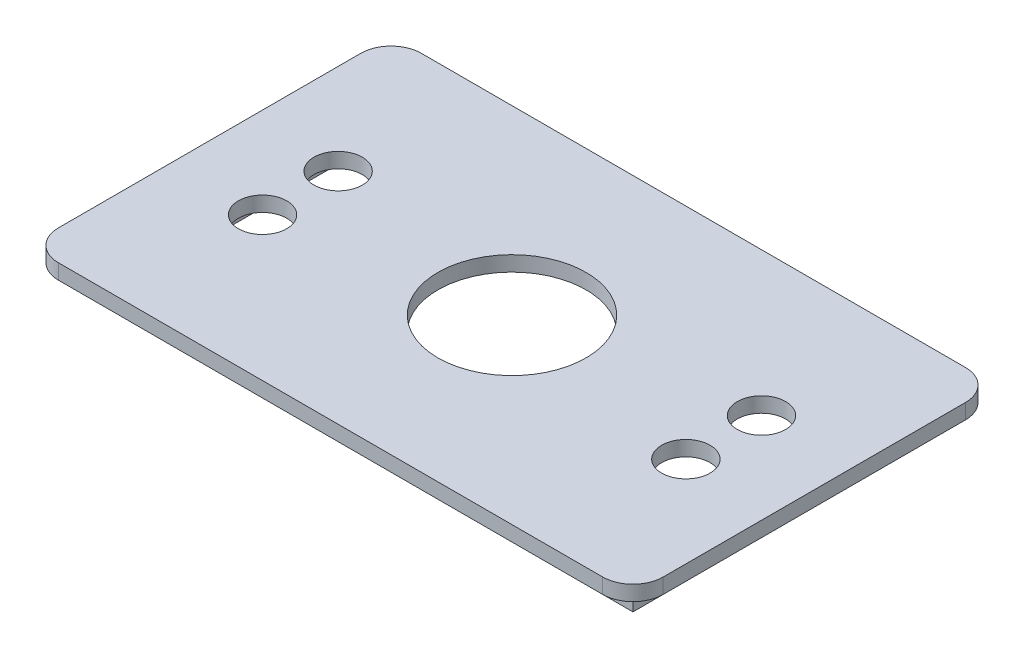
ISO-10303-21;
HEADER;
FILE_DESCRIPTION(('STEP AP214'),'2;1');
FILE_NAME('part.step','',(''),(''),'','','');
FILE_SCHEMA(('AUTOMOTIVE_DESIGN { 1 0 10303 214 1 1 1 1 }'));
ENDSEC;
DATA;
#1=APPLICATION_CONTEXT('core data for automotive mechanical design processes');
#2=APPLICATION_PROTOCOL_DEFINITION('international standard','automotive_design',2000,#1);
#3=PRODUCT_CONTEXT('',#1,'mechanical');
#4=PRODUCT('Part','Part','',(#3));
#5=PRODUCT_RELATED_PRODUCT_CATEGORY('part','',(#4));
#6=PRODUCT_DEFINITION_FORMATION('','',#4);
#7=PRODUCT_DEFINITION_CONTEXT('part definition',#1,'design');
#8=PRODUCT_DEFINITION('design','',#6,#7);
#9=PRODUCT_DEFINITION_SHAPE('','',#8);
#10=(LENGTH_UNIT() NAMED_UNIT(*) SI_UNIT(.MILLI.,.METRE.));
#11=(NAMED_UNIT(*) PLANE_ANGLE_UNIT() SI_UNIT($,.RADIAN.));
#12=(NAMED_UNIT(*) SI_UNIT($,.STERADIAN.) SOLID_ANGLE_UNIT());
#13=UNCERTAINTY_MEASURE_WITH_UNIT(LENGTH_MEASURE(1.E-05),#10,'distance_accuracy_value','');
#14=(GEOMETRIC_REPRESENTATION_CONTEXT(3) GLOBAL_UNCERTAINTY_ASSIGNED_CONTEXT((#13)) GLOBAL_UNIT_ASSIGNED_CONTEXT((#10,
#11,#12)) REPRESENTATION_CONTEXT('',''));
#15=CARTESIAN_POINT('',(0.,0.,0.));
#16=DIRECTION('',(0.,0.,1.));
#17=DIRECTION('',(1.,0.,0.));
#18=AXIS2_PLACEMENT_3D('',#15,#16,#17);
#19=CARTESIAN_POINT('',(-90.,0.,50.));
#20=DIRECTION('',(0.,1.,0.));
#21=DIRECTION('',(0.,0.,1.));
#22=AXIS2_PLACEMENT_3D('',#19,#20,#21);
#23=PLANE('',#22);
#24=CARTESIAN_POINT('',(-90.,0.,50.));
#25=DIRECTION('',(0.,1.,0.));
#26=DIRECTION('',(0.,0.,1.));
#27=AXIS2_PLACEMENT_3D('',#24,#25,#26);
#28=CIRCLE('',#27,9.99999999999999);
#29=CARTESIAN_POINT('',(-100.,0.,50.));
#30=VERTEX_POINT('',#29);
#31=CARTESIAN_POINT('',(-90.,0.,60.));
#32=VERTEX_POINT('',#31);
#33=EDGE_CURVE('E288',#30,#32,#28,.T.);
#34=ORIENTED_EDGE('',*,*,#33,.F.);
#35=DIRECTION('',(0.,0.,1.));
#36=VECTOR('',#35,1.);
#37=CARTESIAN_POINT('',(-100.,0.,-50.));
#38=LINE('',#37,#36);
#39=CARTESIAN_POINT('',(-100.,0.,-50.));
#40=VERTEX_POINT('',#39);
#41=EDGE_CURVE('E297',#40,#30,#38,.T.);
#42=ORIENTED_EDGE('',*,*,#41,.F.);
#43=CARTESIAN_POINT('',(-90.,0.,-50.));
#44=DIRECTION('',(0.,1.,0.));
#45=DIRECTION('',(0.,0.,1.));
#46=AXIS2_PLACEMENT_3D('',#43,#44,#45);
#47=CIRCLE('',#46,9.99999999999999);
#48=CARTESIAN_POINT('',(-90.,0.,-60.));
#49=VERTEX_POINT('',#48);
#50=EDGE_CURVE('E337',#49,#40,#47,.T.);
#51=ORIENTED_EDGE('',*,*,#50,.F.);
#52=DIRECTION('',(-1.,0.,0.));
#53=VECTOR('',#52,1.);
#54=CARTESIAN_POINT('',(-90.,0.,-60.));
#55=LINE('',#54,#53);
#56=CARTESIAN_POINT('',(90.,0.,-60.));
#57=VERTEX_POINT('',#56);
#58=EDGE_CURVE('E334',#57,#49,#55,.T.);
#59=ORIENTED_EDGE('',*,*,#58,.F.);
#60=CARTESIAN_POINT('',(90.,0.,-50.));
#61=DIRECTION('',(0.,1.,0.));
#62=DIRECTION('',(0.,0.,-1.));
#63=AXIS2_PLACEMENT_3D('',#60,#61,#62);
#64=CIRCLE('',#63,9.99999999999999);
#65=CARTESIAN_POINT('',(100.,0.,-50.));
#66=VERTEX_POINT('',#65);
#67=EDGE_CURVE('E331',#66,#57,#64,.T.);
#68=ORIENTED_EDGE('',*,*,#67,.F.);
#69=DIRECTION('',(0.,0.,-1.));
#70=VECTOR('',#69,1.);
#71=CARTESIAN_POINT('',(100.,0.,-50.));
#72=LINE('',#71,#70);
#73=CARTESIAN_POINT('',(100.,0.,50.));
#74=VERTEX_POINT('',#73);
#75=EDGE_CURVE('E328',#74,#66,#72,.T.);
#76=ORIENTED_EDGE('',*,*,#75,.F.);
#77=CARTESIAN_POINT('',(90.,0.,50.));
#78=DIRECTION('',(0.,1.,0.));
#79=DIRECTION('',(0.,0.,1.));
#80=AXIS2_PLACEMENT_3D('',#77,#78,#79);
#81=CIRCLE('',#80,10.);
#82=CARTESIAN_POINT('',(90.,0.,60.));
#83=VERTEX_POINT('',#82);
#84=EDGE_CURVE('E325',#83,#74,#81,.T.);
#85=ORIENTED_EDGE('',*,*,#84,.F.);
#86=DIRECTION('',(1.,0.,0.));
#87=VECTOR('',#86,1.);
#88=CARTESIAN_POINT('',(-90.,0.,60.));
#89=LINE('',#88,#87);
#90=EDGE_CURVE('E322',#32,#83,#89,.T.);
#91=ORIENTED_EDGE('',*,*,#90,.F.);
#92=EDGE_LOOP('',(#34,#42,#51,#59,#68,#76,#85,#91));
#93=FACE_BOUND('',#92,.T.);
#94=DIRECTION('',(1.,0.,0.));
#95=VECTOR('',#94,1.);
#96=CARTESIAN_POINT('',(-90.,0.,-50.));
#97=LINE('',#96,#95);
#98=CARTESIAN_POINT('',(-90.,0.,-50.));
#99=VERTEX_POINT('',#98);
#100=CARTESIAN_POINT('',(90.,0.,-50.));
#101=VERTEX_POINT('',#100);
#102=EDGE_CURVE('E178',#99,#101,#97,.T.);
#103=ORIENTED_EDGE('',*,*,#102,.F.);
#104=DIRECTION('',(0.,0.,-1.));
#105=VECTOR('',#104,1.);
#106=CARTESIAN_POINT('',(-90.,0.,50.));
#107=LINE('',#106,#105);
#108=CARTESIAN_POINT('',(-90.,0.,50.));
#109=VERTEX_POINT('',#108);
#110=EDGE_CURVE('E217',#109,#99,#107,.T.);
#111=ORIENTED_EDGE('',*,*,#110,.F.);
#112=DIRECTION('',(-1.,0.,0.));
#113=VECTOR('',#112,1.);
#114=CARTESIAN_POINT('',(-90.,0.,50.));
#115=LINE('',#114,#113);
#116=CARTESIAN_POINT('',(90.,0.,50.));
#117=VERTEX_POINT('',#116);
#118=EDGE_CURVE('E66',#117,#109,#115,.T.);
#119=ORIENTED_EDGE('',*,*,#118,.F.);
#120=DIRECTION('',(0.,0.,1.));
#121=VECTOR('',#120,1.);
#122=CARTESIAN_POINT('',(90.,0.,-50.));
#123=LINE('',#122,#121);
#124=EDGE_CURVE('E61',#101,#117,#123,.T.);
#125=ORIENTED_EDGE('',*,*,#124,.F.);
#126=EDGE_LOOP('',(#103,#111,#119,#125));
#127=FACE_BOUND('',#126,.T.);
#128=ADVANCED_FACE('F45',(#93,#127),#23,.F.);
#129=CARTESIAN_POINT('',(-90.,5.,50.));
#130=DIRECTION('',(0.,1.,0.));
#131=DIRECTION('',(0.,0.,1.));
#132=AXIS2_PLACEMENT_3D('',#129,#130,#131);
#133=PLANE('',#132);
#134=CARTESIAN_POINT('',(70.,5.,-12.5));
#135=DIRECTION('',(0.,1.,0.));
#136=DIRECTION('',(0.,0.,1.));
#137=AXIS2_PLACEMENT_3D('',#134,#135,#136);
#138=CIRCLE('',#137,8.);
#139=CARTESIAN_POINT('',(70.,5.,-4.5));
#140=VERTEX_POINT('',#139);
#141=EDGE_CURVE('E260',#140,#140,#138,.T.);
#142=ORIENTED_EDGE('',*,*,#141,.F.);
#143=EDGE_LOOP('',(#142));
#144=FACE_BOUND('',#143,.T.);
#145=CARTESIAN_POINT('',(-70.,5.,-12.5));
#146=DIRECTION('',(0.,1.,0.));
#147=DIRECTION('',(0.,0.,1.));
#148=AXIS2_PLACEMENT_3D('',#145,#146,#147);
#149=CIRCLE('',#148,7.99999999999999);
#150=CARTESIAN_POINT('',(-70.,5.,-4.50000000000001));
#151=VERTEX_POINT('',#150);
#152=EDGE_CURVE('E276',#151,#151,#149,.T.);
#153=ORIENTED_EDGE('',*,*,#152,.F.);
#154=EDGE_LOOP('',(#153));
#155=FACE_BOUND('',#154,.T.);
#156=CARTESIAN_POINT('',(-90.,5.,50.));
#157=DIRECTION('',(0.,1.,0.));
#158=DIRECTION('',(0.,0.,1.));
#159=AXIS2_PLACEMENT_3D('',#156,#157,#158);
#160=CIRCLE('',#159,9.99999999999999);
#161=CARTESIAN_POINT('',(-100.,5.,50.));
#162=VERTEX_POINT('',#161);
#163=CARTESIAN_POINT('',(-90.,5.,60.));
#164=VERTEX_POINT('',#163);
#165=EDGE_CURVE('E292',#162,#164,#160,.T.);
#166=ORIENTED_EDGE('',*,*,#165,.T.);
#167=DIRECTION('',(1.,0.,0.));
#168=VECTOR('',#167,1.);
#169=CARTESIAN_POINT('',(-90.,5.,60.));
#170=LINE('',#169,#168);
#171=CARTESIAN_POINT('',(90.,5.,60.));
#172=VERTEX_POINT('',#171);
#173=EDGE_CURVE('E296',#164,#172,#170,.T.);
#174=ORIENTED_EDGE('',*,*,#173,.T.);
#175=CARTESIAN_POINT('',(90.,5.,50.));
#176=DIRECTION('',(0.,1.,0.));
#177=DIRECTION('',(0.,0.,1.));
#178=AXIS2_PLACEMENT_3D('',#175,#176,#177);
#179=CIRCLE('',#178,10.);
#180=CARTESIAN_POINT('',(100.,5.,50.));
#181=VERTEX_POINT('',#180);
#182=EDGE_CURVE('E300',#172,#181,#179,.T.);
#183=ORIENTED_EDGE('',*,*,#182,.T.);
#184=DIRECTION('',(0.,0.,-1.));
#185=VECTOR('',#184,1.);
#186=CARTESIAN_POINT('',(100.,5.,-50.));
#187=LINE('',#186,#185);
#188=CARTESIAN_POINT('',(100.,5.,-50.));
#189=VERTEX_POINT('',#188);
#190=EDGE_CURVE('E303',#181,#189,#187,.T.);
#191=ORIENTED_EDGE('',*,*,#190,.T.);
#192=CARTESIAN_POINT('',(90.,5.,-50.));
#193=DIRECTION('',(0.,1.,0.));
#194=DIRECTION('',(0.,0.,-1.));
#195=AXIS2_PLACEMENT_3D('',#192,#193,#194);
#196=CIRCLE('',#195,9.99999999999999);
#197=CARTESIAN_POINT('',(90.,5.,-60.));
#198=VERTEX_POINT('',#197);
#199=EDGE_CURVE('E306',#189,#198,#196,.T.);
#200=ORIENTED_EDGE('',*,*,#199,.T.);
#201=DIRECTION('',(-1.,0.,0.));
#202=VECTOR('',#201,1.);
#203=CARTESIAN_POINT('',(-90.,5.,-60.));
#204=LINE('',#203,#202);
#205=CARTESIAN_POINT('',(-90.,5.,-60.));
#206=VERTEX_POINT('',#205);
#207=EDGE_CURVE('E309',#198,#206,#204,.T.);
#208=ORIENTED_EDGE('',*,*,#207,.T.);
#209=CARTESIAN_POINT('',(-90.,5.,-50.));
#210=DIRECTION('',(0.,1.,0.));
#211=DIRECTION('',(0.,0.,1.));
#212=AXIS2_PLACEMENT_3D('',#209,#210,#211);
#213=CIRCLE('',#212,9.99999999999999);
#214=CARTESIAN_POINT('',(-100.,5.,-50.));
#215=VERTEX_POINT('',#214);
#216=EDGE_CURVE('E312',#206,#215,#213,.T.);
#217=ORIENTED_EDGE('',*,*,#216,.T.);
#218=DIRECTION('',(0.,0.,1.));
#219=VECTOR('',#218,1.);
#220=CARTESIAN_POINT('',(-100.,5.,-50.));
#221=LINE('',#220,#219);
#222=EDGE_CURVE('E315',#215,#162,#221,.T.);
#223=ORIENTED_EDGE('',*,*,#222,.T.);
#224=EDGE_LOOP('',(#166,#174,#183,#191,#200,#208,#217,#223));
#225=FACE_BOUND('',#224,.T.);
#226=CARTESIAN_POINT('',(0.,5.,0.));
#227=DIRECTION('',(0.,1.,0.));
#228=DIRECTION('',(0.,0.,1.));
#229=AXIS2_PLACEMENT_3D('',#226,#227,#228);
#230=CIRCLE('',#229,24.5);
#231=CARTESIAN_POINT('',(0.,5.,24.5));
#232=VERTEX_POINT('',#231);
#233=EDGE_CURVE('E284',#232,#232,#230,.T.);
#234=ORIENTED_EDGE('',*,*,#233,.F.);
#235=EDGE_LOOP('',(#234));
#236=FACE_BOUND('',#235,.T.);
#237=CARTESIAN_POINT('',(-70.,5.,12.5));
#238=DIRECTION('',(0.,1.,0.));
#239=DIRECTION('',(0.,0.,1.));
#240=AXIS2_PLACEMENT_3D('',#237,#238,#239);
#241=CIRCLE('',#240,7.99999999999999);
#242=CARTESIAN_POINT('',(-70.,5.,20.5));
#243=VERTEX_POINT('',#242);
#244=EDGE_CURVE('E268',#243,#243,#241,.T.);
#245=ORIENTED_EDGE('',*,*,#244,.F.);
#246=EDGE_LOOP('',(#245));
#247=FACE_BOUND('',#246,.T.);
#248=CARTESIAN_POINT('',(70.,5.,12.5));
#249=DIRECTION('',(0.,1.,0.));
#250=DIRECTION('',(0.,0.,1.));
#251=AXIS2_PLACEMENT_3D('',#248,#249,#250);
#252=CIRCLE('',#251,8.);
#253=CARTESIAN_POINT('',(70.,5.,20.5));
#254=VERTEX_POINT('',#253);
#255=EDGE_CURVE('E252',#254,#254,#252,.T.);
#256=ORIENTED_EDGE('',*,*,#255,.F.);
#257=EDGE_LOOP('',(#256));
#258=FACE_BOUND('',#257,.T.);
#259=ADVANCED_FACE('F388',(#144,#155,#225,#236,#247,#258),#133,.T.);
#260=DIRECTION('',(0.,0.,1.));
#261=VECTOR('',#260,1.);
#262=CARTESIAN_POINT('',(87.,0.,-47.));
#263=LINE('',#262,#261);
#264=CARTESIAN_POINT('',(87.,0.,-47.));
#265=VERTEX_POINT('',#264);
#266=CARTESIAN_POINT('',(87.,0.,47.));
#267=VERTEX_POINT('',#266);
#268=EDGE_CURVE('E170',#265,#267,#263,.T.);
#269=ORIENTED_EDGE('',*,*,#268,.T.);
#270=DIRECTION('',(-1.,0.,0.));
#271=VECTOR('',#270,1.);
#272=CARTESIAN_POINT('',(-87.,0.,47.));
#273=LINE('',#272,#271);
#274=CARTESIAN_POINT('',(-87.,0.,47.));
#275=VERTEX_POINT('',#274);
#276=EDGE_CURVE('E193',#267,#275,#273,.T.);
#277=ORIENTED_EDGE('',*,*,#276,.T.);
#278=DIRECTION('',(0.,0.,-1.));
#279=VECTOR('',#278,1.);
#280=CARTESIAN_POINT('',(-87.,0.,47.));
#281=LINE('',#280,#279);
#282=CARTESIAN_POINT('',(-87.,0.,-47.));
#283=VERTEX_POINT('',#282);
#284=EDGE_CURVE('E176',#275,#283,#281,.T.);
#285=ORIENTED_EDGE('',*,*,#284,.T.);
#286=DIRECTION('',(1.,0.,0.));
#287=VECTOR('',#286,1.);
#288=CARTESIAN_POINT('',(-87.,0.,-47.));
#289=LINE('',#288,#287);
#290=EDGE_CURVE('E198',#283,#265,#289,.T.);
#291=ORIENTED_EDGE('',*,*,#290,.T.);
#292=EDGE_LOOP('',(#269,#277,#285,#291));
#293=FACE_BOUND('',#292,.T.);
#294=CARTESIAN_POINT('',(0.,0.,0.));
#295=DIRECTION('',(0.,1.,0.));
#296=DIRECTION('',(0.,0.,1.));
#297=AXIS2_PLACEMENT_3D('',#294,#295,#296);
#298=CIRCLE('',#297,24.5);
#299=CARTESIAN_POINT('',(0.,0.,24.5));
#300=VERTEX_POINT('',#299);
#301=EDGE_CURVE('E280',#300,#300,#298,.T.);
#302=ORIENTED_EDGE('',*,*,#301,.T.);
#303=EDGE_LOOP('',(#302));
#304=FACE_BOUND('',#303,.T.);
#305=CARTESIAN_POINT('',(-70.,0.,-12.5));
#306=DIRECTION('',(0.,1.,0.));
#307=DIRECTION('',(0.,0.,1.));
#308=AXIS2_PLACEMENT_3D('',#305,#306,#307);
#309=CIRCLE('',#308,7.99999999999999);
#310=CARTESIAN_POINT('',(-70.,0.,-4.50000000000001));
#311=VERTEX_POINT('',#310);
#312=EDGE_CURVE('E272',#311,#311,#309,.T.);
#313=ORIENTED_EDGE('',*,*,#312,.T.);
#314=EDGE_LOOP('',(#313));
#315=FACE_BOUND('',#314,.T.);
#316=CARTESIAN_POINT('',(-70.,0.,12.5));
#317=DIRECTION('',(0.,1.,0.));
#318=DIRECTION('',(0.,0.,1.));
#319=AXIS2_PLACEMENT_3D('',#316,#317,#318);
#320=CIRCLE('',#319,7.99999999999999);
#321=CARTESIAN_POINT('',(-70.,0.,20.5));
#322=VERTEX_POINT('',#321);
#323=EDGE_CURVE('E264',#322,#322,#320,.T.);
#324=ORIENTED_EDGE('',*,*,#323,.T.);
#325=EDGE_LOOP('',(#324));
#326=FACE_BOUND('',#325,.T.);
#327=CARTESIAN_POINT('',(70.,0.,-12.5));
#328=DIRECTION('',(0.,1.,0.));
#329=DIRECTION('',(0.,0.,1.));
#330=AXIS2_PLACEMENT_3D('',#327,#328,#329);
#331=CIRCLE('',#330,8.);
#332=CARTESIAN_POINT('',(70.,0.,-4.5));
#333=VERTEX_POINT('',#332);
#334=EDGE_CURVE('E256',#333,#333,#331,.T.);
#335=ORIENTED_EDGE('',*,*,#334,.T.);
#336=EDGE_LOOP('',(#335));
#337=FACE_BOUND('',#336,.T.);
#338=CARTESIAN_POINT('',(70.,0.,12.5));
#339=DIRECTION('',(0.,1.,0.));
#340=DIRECTION('',(0.,0.,1.));
#341=AXIS2_PLACEMENT_3D('',#338,#339,#340);
#342=CIRCLE('',#341,8.);
#343=CARTESIAN_POINT('',(70.,0.,20.5));
#344=VERTEX_POINT('',#343);
#345=EDGE_CURVE('E251',#344,#344,#342,.T.);
#346=ORIENTED_EDGE('',*,*,#345,.T.);
#347=EDGE_LOOP('',(#346));
#348=FACE_BOUND('',#347,.T.);
#349=ADVANCED_FACE('F417',(#293,#304,#315,#326,#337,#348),#23,.F.);
#350=CARTESIAN_POINT('',(-90.,5.,50.));
#351=DIRECTION('',(0.,-1.,0.));
#352=DIRECTION('',(0.,0.,-1.));
#353=AXIS2_PLACEMENT_3D('',#350,#351,#352);
#354=CYLINDRICAL_SURFACE('',#353,9.99999999999999);
#355=ORIENTED_EDGE('',*,*,#33,.T.);
#356=DIRECTION('',(0.,-1.,0.));
#357=VECTOR('',#356,1.);
#358=CARTESIAN_POINT('',(-90.,5.,60.));
#359=LINE('',#358,#357);
#360=EDGE_CURVE('E11',#164,#32,#359,.T.);
#361=ORIENTED_EDGE('',*,*,#360,.F.);
#362=ORIENTED_EDGE('',*,*,#165,.F.);
#363=DIRECTION('',(0.,-1.,0.));
#364=VECTOR('',#363,1.);
#365=CARTESIAN_POINT('',(-100.,5.,50.));
#366=LINE('',#365,#364);
#367=EDGE_CURVE('E318',#162,#30,#366,.T.);
#368=ORIENTED_EDGE('',*,*,#367,.T.);
#369=EDGE_LOOP('',(#355,#361,#362,#368));
#370=FACE_BOUND('',#369,.T.);
#371=ADVANCED_FACE('F47',(#370),#354,.T.);
#372=CARTESIAN_POINT('',(-90.,5.,60.));
#373=DIRECTION('',(0.,0.,-1.));
#374=DIRECTION('',(-1.,0.,0.));
#375=AXIS2_PLACEMENT_3D('',#372,#373,#374);
#376=PLANE('',#375);
#377=ORIENTED_EDGE('',*,*,#90,.T.);
#378=DIRECTION('',(0.,-1.,0.));
#379=VECTOR('',#378,1.);
#380=CARTESIAN_POINT('',(90.,5.,60.));
#381=LINE('',#380,#379);
#382=EDGE_CURVE('E54',#172,#83,#381,.T.);
#383=ORIENTED_EDGE('',*,*,#382,.F.);
#384=ORIENTED_EDGE('',*,*,#173,.F.);
#385=ORIENTED_EDGE('',*,*,#360,.T.);
#386=EDGE_LOOP('',(#377,#383,#384,#385));
#387=FACE_BOUND('',#386,.T.);
#388=ADVANCED_FACE('F393',(#387),#376,.F.);
#389=CARTESIAN_POINT('',(90.,5.,50.));
#390=DIRECTION('',(0.,-1.,0.));
#391=DIRECTION('',(0.,0.,-1.));
#392=AXIS2_PLACEMENT_3D('',#389,#390,#391);
#393=CYLINDRICAL_SURFACE('',#392,10.);
#394=ORIENTED_EDGE('',*,*,#84,.T.);
#395=DIRECTION('',(0.,-1.,0.));
#396=VECTOR('',#395,1.);
#397=CARTESIAN_POINT('',(100.,5.,50.));
#398=LINE('',#397,#396);
#399=EDGE_CURVE('E361',#181,#74,#398,.T.);
#400=ORIENTED_EDGE('',*,*,#399,.F.);
#401=ORIENTED_EDGE('',*,*,#182,.F.);
#402=ORIENTED_EDGE('',*,*,#382,.T.);
#403=EDGE_LOOP('',(#394,#400,#401,#402));
#404=FACE_BOUND('',#403,.T.);
#405=ADVANCED_FACE('F370',(#404),#393,.T.);
#406=CARTESIAN_POINT('',(100.,5.,-50.));
#407=DIRECTION('',(-1.,0.,0.));
#408=DIRECTION('',(0.,0.,1.));
#409=AXIS2_PLACEMENT_3D('',#406,#407,#408);
#410=PLANE('',#409);
#411=ORIENTED_EDGE('',*,*,#75,.T.);
#412=DIRECTION('',(0.,-1.,0.));
#413=VECTOR('',#412,1.);
#414=CARTESIAN_POINT('',(100.,5.,-50.));
#415=LINE('',#414,#413);
#416=EDGE_CURVE('E357',#189,#66,#415,.T.);
#417=ORIENTED_EDGE('',*,*,#416,.F.);
#418=ORIENTED_EDGE('',*,*,#190,.F.);
#419=ORIENTED_EDGE('',*,*,#399,.T.);
#420=EDGE_LOOP('',(#411,#417,#418,#419));
#421=FACE_BOUND('',#420,.T.);
#422=ADVANCED_FACE('F380',(#421),#410,.F.);
#423=CARTESIAN_POINT('',(90.,5.,-50.));
#424=DIRECTION('',(0.,-1.,0.));
#425=DIRECTION('',(0.,0.,-1.));
#426=AXIS2_PLACEMENT_3D('',#423,#424,#425);
#427=CYLINDRICAL_SURFACE('',#426,9.99999999999999);
#428=ORIENTED_EDGE('',*,*,#67,.T.);
#429=DIRECTION('',(0.,-1.,0.));
#430=VECTOR('',#429,1.);
#431=CARTESIAN_POINT('',(90.,5.,-60.));
#432=LINE('',#431,#430);
#433=EDGE_CURVE('E353',#198,#57,#432,.T.);
#434=ORIENTED_EDGE('',*,*,#433,.F.);
#435=ORIENTED_EDGE('',*,*,#199,.F.);
#436=ORIENTED_EDGE('',*,*,#416,.T.);
#437=EDGE_LOOP('',(#428,#434,#435,#436));
#438=FACE_BOUND('',#437,.T.);
#439=ADVANCED_FACE('F384',(#438),#427,.T.);
#440=CARTESIAN_POINT('',(-90.,5.,-60.));
#441=DIRECTION('',(0.,0.,1.));
#442=DIRECTION('',(1.,0.,0.));
#443=AXIS2_PLACEMENT_3D('',#440,#441,#442);
#444=PLANE('',#443);
#445=ORIENTED_EDGE('',*,*,#58,.T.);
#446=DIRECTION('',(0.,-1.,0.));
#447=VECTOR('',#446,1.);
#448=CARTESIAN_POINT('',(-90.,5.,-60.));
#449=LINE('',#448,#447);
#450=EDGE_CURVE('E349',#206,#49,#449,.T.);
#451=ORIENTED_EDGE('',*,*,#450,.F.);
#452=ORIENTED_EDGE('',*,*,#207,.F.);
#453=ORIENTED_EDGE('',*,*,#433,.T.);
#454=EDGE_LOOP('',(#445,#451,#452,#453));
#455=FACE_BOUND('',#454,.T.);
#456=ADVANCED_FACE('F406',(#455),#444,.F.);
#457=CARTESIAN_POINT('',(-90.,5.,-50.));
#458=DIRECTION('',(0.,-1.,0.));
#459=DIRECTION('',(0.,0.,-1.));
#460=AXIS2_PLACEMENT_3D('',#457,#458,#459);
#461=CYLINDRICAL_SURFACE('',#460,9.99999999999999);
#462=ORIENTED_EDGE('',*,*,#50,.T.);
#463=DIRECTION('',(0.,-1.,0.));
#464=VECTOR('',#463,1.);
#465=CARTESIAN_POINT('',(-100.,5.,-50.));
#466=LINE('',#465,#464);
#467=EDGE_CURVE('E345',#215,#40,#466,.T.);
#468=ORIENTED_EDGE('',*,*,#467,.F.);
#469=ORIENTED_EDGE('',*,*,#216,.F.);
#470=ORIENTED_EDGE('',*,*,#450,.T.);
#471=EDGE_LOOP('',(#462,#468,#469,#470));
#472=FACE_BOUND('',#471,.T.);
#473=ADVANCED_FACE('F404',(#472),#461,.T.);
#474=CARTESIAN_POINT('',(-100.,5.,-50.));
#475=DIRECTION('',(1.,0.,0.));
#476=DIRECTION('',(0.,0.,-1.));
#477=AXIS2_PLACEMENT_3D('',#474,#475,#476);
#478=PLANE('',#477);
#479=ORIENTED_EDGE('',*,*,#41,.T.);
#480=ORIENTED_EDGE('',*,*,#367,.F.);
#481=ORIENTED_EDGE('',*,*,#222,.F.);
#482=ORIENTED_EDGE('',*,*,#467,.T.);
#483=EDGE_LOOP('',(#479,#480,#481,#482));
#484=FACE_BOUND('',#483,.T.);
#485=ADVANCED_FACE('F399',(#484),#478,.F.);
#486=CARTESIAN_POINT('',(0.,5.,0.));
#487=DIRECTION('',(0.,-1.,0.));
#488=DIRECTION('',(0.,0.,-1.));
#489=AXIS2_PLACEMENT_3D('',#486,#487,#488);
#490=CYLINDRICAL_SURFACE('',#489,24.5);
#491=ORIENTED_EDGE('',*,*,#233,.T.);
#492=EDGE_LOOP('',(#491));
#493=FACE_BOUND('',#492,.T.);
#494=ORIENTED_EDGE('',*,*,#301,.F.);
#495=EDGE_LOOP('',(#494));
#496=FACE_BOUND('',#495,.T.);
#497=ADVANCED_FACE('F465',(#493,#496),#490,.F.);
#498=CARTESIAN_POINT('',(-70.,5.,-12.5));
#499=DIRECTION('',(0.,-1.,0.));
#500=DIRECTION('',(0.,0.,-1.));
#501=AXIS2_PLACEMENT_3D('',#498,#499,#500);
#502=CYLINDRICAL_SURFACE('',#501,7.99999999999999);
#503=ORIENTED_EDGE('',*,*,#152,.T.);
#504=EDGE_LOOP('',(#503));
#505=FACE_BOUND('',#504,.T.);
#506=ORIENTED_EDGE('',*,*,#312,.F.);
#507=EDGE_LOOP('',(#506));
#508=FACE_BOUND('',#507,.T.);
#509=ADVANCED_FACE('F461',(#505,#508),#502,.F.);
#510=CARTESIAN_POINT('',(-70.,5.,12.5));
#511=DIRECTION('',(0.,-1.,0.));
#512=DIRECTION('',(0.,0.,-1.));
#513=AXIS2_PLACEMENT_3D('',#510,#511,#512);
#514=CYLINDRICAL_SURFACE('',#513,7.99999999999999);
#515=ORIENTED_EDGE('',*,*,#244,.T.);
#516=EDGE_LOOP('',(#515));
#517=FACE_BOUND('',#516,.T.);
#518=ORIENTED_EDGE('',*,*,#323,.F.);
#519=EDGE_LOOP('',(#518));
#520=FACE_BOUND('',#519,.T.);
#521=ADVANCED_FACE('F453',(#517,#520),#514,.F.);
#522=CARTESIAN_POINT('',(70.,5.,-12.5));
#523=DIRECTION('',(0.,-1.,0.));
#524=DIRECTION('',(0.,0.,-1.));
#525=AXIS2_PLACEMENT_3D('',#522,#523,#524);
#526=CYLINDRICAL_SURFACE('',#525,8.);
#527=ORIENTED_EDGE('',*,*,#141,.T.);
#528=EDGE_LOOP('',(#527));
#529=FACE_BOUND('',#528,.T.);
#530=ORIENTED_EDGE('',*,*,#334,.F.);
#531=EDGE_LOOP('',(#530));
#532=FACE_BOUND('',#531,.T.);
#533=ADVANCED_FACE('F443',(#529,#532),#526,.F.);
#534=CARTESIAN_POINT('',(70.,5.,12.5));
#535=DIRECTION('',(0.,-1.,0.));
#536=DIRECTION('',(0.,0.,-1.));
#537=AXIS2_PLACEMENT_3D('',#534,#535,#536);
#538=CYLINDRICAL_SURFACE('',#537,8.);
#539=ORIENTED_EDGE('',*,*,#255,.T.);
#540=EDGE_LOOP('',(#539));
#541=FACE_BOUND('',#540,.T.);
#542=ORIENTED_EDGE('',*,*,#345,.F.);
#543=EDGE_LOOP('',(#542));
#544=FACE_BOUND('',#543,.T.);
#545=ADVANCED_FACE('F441',(#541,#544),#538,.F.);
#546=CARTESIAN_POINT('',(0.,-10.,0.));
#547=DIRECTION('',(0.,-1.,0.));
#548=DIRECTION('',(0.,0.,-1.));
#549=AXIS2_PLACEMENT_3D('',#546,#547,#548);
#550=PLANE('',#549);
#551=DIRECTION('',(1.,0.,0.));
#552=VECTOR('',#551,1.);
#553=CARTESIAN_POINT('',(-90.,-10.,-50.));
#554=LINE('',#553,#552);
#555=CARTESIAN_POINT('',(-90.,-10.,-50.));
#556=VERTEX_POINT('',#555);
#557=CARTESIAN_POINT('',(90.,-10.,-50.));
#558=VERTEX_POINT('',#557);
#559=EDGE_CURVE('E212',#556,#558,#554,.T.);
#560=ORIENTED_EDGE('',*,*,#559,.T.);
#561=DIRECTION('',(0.,0.,1.));
#562=VECTOR('',#561,1.);
#563=CARTESIAN_POINT('',(90.,-10.,-50.));
#564=LINE('',#563,#562);
#565=CARTESIAN_POINT('',(90.,-10.,50.));
#566=VERTEX_POINT('',#565);
#567=EDGE_CURVE('E216',#558,#566,#564,.T.);
#568=ORIENTED_EDGE('',*,*,#567,.T.);
#569=DIRECTION('',(-1.,0.,0.));
#570=VECTOR('',#569,1.);
#571=CARTESIAN_POINT('',(-90.,-10.,50.));
#572=LINE('',#571,#570);
#573=CARTESIAN_POINT('',(-90.,-10.,50.));
#574=VERTEX_POINT('',#573);
#575=EDGE_CURVE('E220',#566,#574,#572,.T.);
#576=ORIENTED_EDGE('',*,*,#575,.T.);
#577=DIRECTION('',(0.,0.,-1.));
#578=VECTOR('',#577,1.);
#579=CARTESIAN_POINT('',(-90.,-10.,50.));
#580=LINE('',#579,#578);
#581=EDGE_CURVE('E223',#574,#556,#580,.T.);
#582=ORIENTED_EDGE('',*,*,#581,.T.);
#583=EDGE_LOOP('',(#560,#568,#576,#582));
#584=FACE_BOUND('',#583,.T.);
#585=DIRECTION('',(0.,0.,-1.));
#586=VECTOR('',#585,1.);
#587=CARTESIAN_POINT('',(-87.,-10.,47.));
#588=LINE('',#587,#586);
#589=CARTESIAN_POINT('',(-87.,-10.,47.));
#590=VERTEX_POINT('',#589);
#591=CARTESIAN_POINT('',(-87.,-10.,-47.));
#592=VERTEX_POINT('',#591);
#593=EDGE_CURVE('E169',#590,#592,#588,.T.);
#594=ORIENTED_EDGE('',*,*,#593,.F.);
#595=DIRECTION('',(-1.,0.,0.));
#596=VECTOR('',#595,1.);
#597=CARTESIAN_POINT('',(-87.,-10.,47.));
#598=LINE('',#597,#596);
#599=CARTESIAN_POINT('',(87.,-10.,47.));
#600=VERTEX_POINT('',#599);
#601=EDGE_CURVE('E158',#600,#590,#598,.T.);
#602=ORIENTED_EDGE('',*,*,#601,.F.);
#603=DIRECTION('',(0.,0.,1.));
#604=VECTOR('',#603,1.);
#605=CARTESIAN_POINT('',(87.,-10.,-47.));
#606=LINE('',#605,#604);
#607=CARTESIAN_POINT('',(87.,-10.,-47.));
#608=VERTEX_POINT('',#607);
#609=EDGE_CURVE('E188',#608,#600,#606,.T.);
#610=ORIENTED_EDGE('',*,*,#609,.F.);
#611=DIRECTION('',(1.,0.,0.));
#612=VECTOR('',#611,1.);
#613=CARTESIAN_POINT('',(-87.,-10.,-47.));
#614=LINE('',#613,#612);
#615=EDGE_CURVE('E184',#592,#608,#614,.T.);
#616=ORIENTED_EDGE('',*,*,#615,.F.);
#617=EDGE_LOOP('',(#594,#602,#610,#616));
#618=FACE_BOUND('',#617,.T.);
#619=ADVANCED_FACE('F182',(#584,#618),#550,.T.);
#620=CARTESIAN_POINT('',(-90.,-10.,-50.));
#621=DIRECTION('',(0.,0.,1.));
#622=DIRECTION('',(1.,0.,0.));
#623=AXIS2_PLACEMENT_3D('',#620,#621,#622);
#624=PLANE('',#623);
#625=ORIENTED_EDGE('',*,*,#102,.T.);
#626=DIRECTION('',(0.,1.,0.));
#627=VECTOR('',#626,1.);
#628=CARTESIAN_POINT('',(90.,-10.,-50.));
#629=LINE('',#628,#627);
#630=EDGE_CURVE('E248',#558,#101,#629,.T.);
#631=ORIENTED_EDGE('',*,*,#630,.F.);
#632=ORIENTED_EDGE('',*,*,#559,.F.);
#633=DIRECTION('',(0.,1.,0.));
#634=VECTOR('',#633,1.);
#635=CARTESIAN_POINT('',(-90.,-10.,-50.));
#636=LINE('',#635,#634);
#637=EDGE_CURVE('E226',#556,#99,#636,.T.);
#638=ORIENTED_EDGE('',*,*,#637,.T.);
#639=EDGE_LOOP('',(#625,#631,#632,#638));
#640=FACE_BOUND('',#639,.T.);
#641=ADVANCED_FACE('F450',(#640),#624,.F.);
#642=CARTESIAN_POINT('',(90.,-10.,-50.));
#643=DIRECTION('',(-1.,0.,0.));
#644=DIRECTION('',(0.,0.,1.));
#645=AXIS2_PLACEMENT_3D('',#642,#643,#644);
#646=PLANE('',#645);
#647=ORIENTED_EDGE('',*,*,#124,.T.);
#648=DIRECTION('',(0.,1.,0.));
#649=VECTOR('',#648,1.);
#650=CARTESIAN_POINT('',(90.,-10.,50.));
#651=LINE('',#650,#649);
#652=EDGE_CURVE('E244',#566,#117,#651,.T.);
#653=ORIENTED_EDGE('',*,*,#652,.F.);
#654=ORIENTED_EDGE('',*,*,#567,.F.);
#655=ORIENTED_EDGE('',*,*,#630,.T.);
#656=EDGE_LOOP('',(#647,#653,#654,#655));
#657=FACE_BOUND('',#656,.T.);
#658=ADVANCED_FACE('F629',(#657),#646,.F.);
#659=CARTESIAN_POINT('',(-90.,-10.,50.));
#660=DIRECTION('',(0.,0.,-1.));
#661=DIRECTION('',(-1.,0.,0.));
#662=AXIS2_PLACEMENT_3D('',#659,#660,#661);
#663=PLANE('',#662);
#664=ORIENTED_EDGE('',*,*,#118,.T.);
#665=DIRECTION('',(0.,1.,0.));
#666=VECTOR('',#665,1.);
#667=CARTESIAN_POINT('',(-90.,-10.,50.));
#668=LINE('',#667,#666);
#669=EDGE_CURVE('E240',#574,#109,#668,.T.);
#670=ORIENTED_EDGE('',*,*,#669,.F.);
#671=ORIENTED_EDGE('',*,*,#575,.F.);
#672=ORIENTED_EDGE('',*,*,#652,.T.);
#673=EDGE_LOOP('',(#664,#670,#671,#672));
#674=FACE_BOUND('',#673,.T.);
#675=ADVANCED_FACE('F639',(#674),#663,.F.);
#676=CARTESIAN_POINT('',(-90.,-10.,50.));
#677=DIRECTION('',(1.,0.,0.));
#678=DIRECTION('',(0.,0.,-1.));
#679=AXIS2_PLACEMENT_3D('',#676,#677,#678);
#680=PLANE('',#679);
#681=ORIENTED_EDGE('',*,*,#110,.T.);
#682=ORIENTED_EDGE('',*,*,#637,.F.);
#683=ORIENTED_EDGE('',*,*,#581,.F.);
#684=ORIENTED_EDGE('',*,*,#669,.T.);
#685=EDGE_LOOP('',(#681,#682,#683,#684));
#686=FACE_BOUND('',#685,.T.);
#687=ADVANCED_FACE('F649',(#686),#680,.F.);
#688=CARTESIAN_POINT('',(-87.,-10.,47.));
#689=DIRECTION('',(0.,0.,-1.));
#690=DIRECTION('',(-1.,0.,0.));
#691=AXIS2_PLACEMENT_3D('',#688,#689,#690);
#692=PLANE('',#691);
#693=ORIENTED_EDGE('',*,*,#276,.F.);
#694=DIRECTION('',(0.,1.,0.));
#695=VECTOR('',#694,1.);
#696=CARTESIAN_POINT('',(87.,-10.,47.));
#697=LINE('',#696,#695);
#698=EDGE_CURVE('E164',#600,#267,#697,.T.);
#699=ORIENTED_EDGE('',*,*,#698,.F.);
#700=ORIENTED_EDGE('',*,*,#601,.T.);
#701=DIRECTION('',(0.,1.,0.));
#702=VECTOR('',#701,1.);
#703=CARTESIAN_POINT('',(-87.,-10.,47.));
#704=LINE('',#703,#702);
#705=EDGE_CURVE('E162',#590,#275,#704,.T.);
#706=ORIENTED_EDGE('',*,*,#705,.T.);
#707=EDGE_LOOP('',(#693,#699,#700,#706));
#708=FACE_BOUND('',#707,.T.);
#709=ADVANCED_FACE('F161',(#708),#692,.T.);
#710=CARTESIAN_POINT('',(-87.,-10.,47.));
#711=DIRECTION('',(1.,0.,0.));
#712=DIRECTION('',(0.,0.,-1.));
#713=AXIS2_PLACEMENT_3D('',#710,#711,#712);
#714=PLANE('',#713);
#715=ORIENTED_EDGE('',*,*,#284,.F.);
#716=ORIENTED_EDGE('',*,*,#705,.F.);
#717=ORIENTED_EDGE('',*,*,#593,.T.);
#718=DIRECTION('',(0.,1.,0.));
#719=VECTOR('',#718,1.);
#720=CARTESIAN_POINT('',(-87.,-10.,-47.));
#721=LINE('',#720,#719);
#722=EDGE_CURVE('E179',#592,#283,#721,.T.);
#723=ORIENTED_EDGE('',*,*,#722,.T.);
#724=EDGE_LOOP('',(#715,#716,#717,#723));
#725=FACE_BOUND('',#724,.T.);
#726=ADVANCED_FACE('F173',(#725),#714,.T.);
#727=CARTESIAN_POINT('',(-87.,-10.,-47.));
#728=DIRECTION('',(0.,0.,1.));
#729=DIRECTION('',(1.,0.,0.));
#730=AXIS2_PLACEMENT_3D('',#727,#728,#729);
#731=PLANE('',#730);
#732=ORIENTED_EDGE('',*,*,#290,.F.);
#733=ORIENTED_EDGE('',*,*,#722,.F.);
#734=ORIENTED_EDGE('',*,*,#615,.T.);
#735=DIRECTION('',(0.,1.,0.));
#736=VECTOR('',#735,1.);
#737=CARTESIAN_POINT('',(87.,-10.,-47.));
#738=LINE('',#737,#736);
#739=EDGE_CURVE('E207',#608,#265,#738,.T.);
#740=ORIENTED_EDGE('',*,*,#739,.T.);
#741=EDGE_LOOP('',(#732,#733,#734,#740));
#742=FACE_BOUND('',#741,.T.);
#743=ADVANCED_FACE('F679',(#742),#731,.T.);
#744=CARTESIAN_POINT('',(87.,-10.,-47.));
#745=DIRECTION('',(-1.,0.,0.));
#746=DIRECTION('',(0.,0.,1.));
#747=AXIS2_PLACEMENT_3D('',#744,#745,#746);
#748=PLANE('',#747);
#749=ORIENTED_EDGE('',*,*,#268,.F.);
#750=ORIENTED_EDGE('',*,*,#739,.F.);
#751=ORIENTED_EDGE('',*,*,#609,.T.);
#752=ORIENTED_EDGE('',*,*,#698,.T.);
#753=EDGE_LOOP('',(#749,#750,#751,#752));
#754=FACE_BOUND('',#753,.T.);
#755=ADVANCED_FACE('F689',(#754),#748,.T.);
#756=CLOSED_SHELL('',(#128,#259,#349,#371,#388,#405,#422,#439,#456,#473,#485,#497,#509,#521,
#533,#545,#619,#641,#658,#675,#687,#709,#726,#743,#755));
#757=MANIFOLD_SOLID_BREP('B2',#756);
#758=ADVANCED_BREP_SHAPE_REPRESENTATION('',(#18,#757),#14);
#759=SHAPE_DEFINITION_REPRESENTATION(#9,#758);
ENDSEC;
END-ISO-10303-21;
